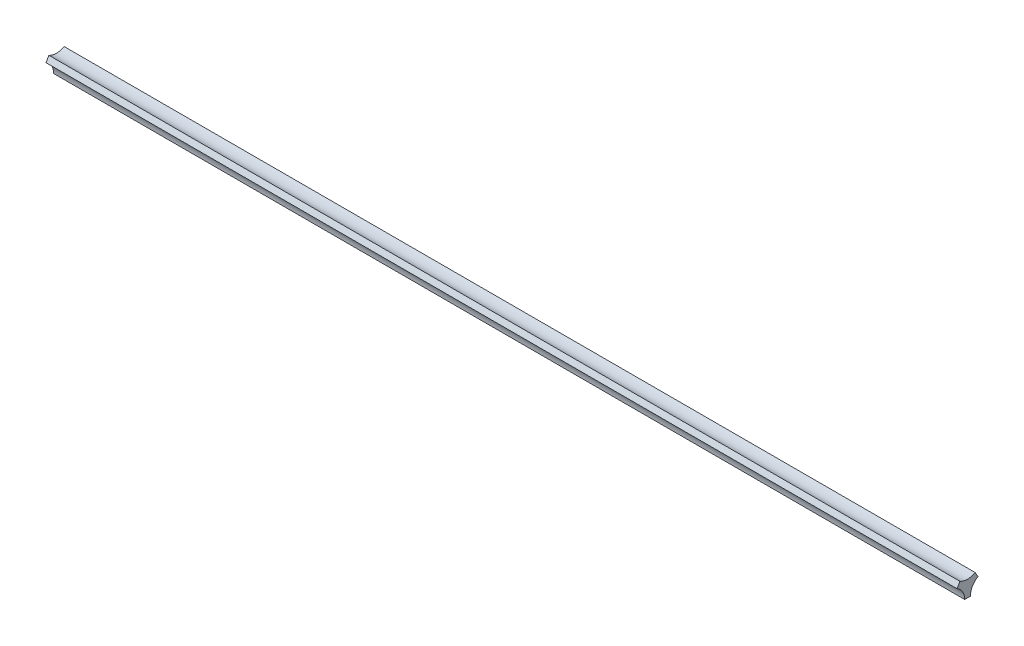
ISO-10303-21;
HEADER;
FILE_DESCRIPTION(('STEP AP214'),'2;1');
FILE_NAME('part.step','',(''),(''),'','','');
FILE_SCHEMA(('AUTOMOTIVE_DESIGN { 1 0 10303 214 1 1 1 1 }'));
ENDSEC;
DATA;
#1=APPLICATION_CONTEXT('core data for automotive mechanical design processes');
#2=APPLICATION_PROTOCOL_DEFINITION('international standard','automotive_design',2000,#1);
#3=PRODUCT_CONTEXT('',#1,'mechanical');
#4=PRODUCT('Part','Part','',(#3));
#5=PRODUCT_RELATED_PRODUCT_CATEGORY('part','',(#4));
#6=PRODUCT_DEFINITION_FORMATION('','',#4);
#7=PRODUCT_DEFINITION_CONTEXT('part definition',#1,'design');
#8=PRODUCT_DEFINITION('design','',#6,#7);
#9=PRODUCT_DEFINITION_SHAPE('','',#8);
#10=(LENGTH_UNIT() NAMED_UNIT(*) SI_UNIT(.MILLI.,.METRE.));
#11=(NAMED_UNIT(*) PLANE_ANGLE_UNIT() SI_UNIT($,.RADIAN.));
#12=(NAMED_UNIT(*) SI_UNIT($,.STERADIAN.) SOLID_ANGLE_UNIT());
#13=UNCERTAINTY_MEASURE_WITH_UNIT(LENGTH_MEASURE(1.E-05),#10,'distance_accuracy_value','');
#14=(GEOMETRIC_REPRESENTATION_CONTEXT(3) GLOBAL_UNCERTAINTY_ASSIGNED_CONTEXT((#13)) GLOBAL_UNIT_ASSIGNED_CONTEXT((#10,
#11,#12)) REPRESENTATION_CONTEXT('',''));
#15=CARTESIAN_POINT('',(0.,0.,0.));
#16=DIRECTION('',(0.,0.,1.));
#17=DIRECTION('',(1.,0.,0.));
#18=AXIS2_PLACEMENT_3D('',#15,#16,#17);
#19=CARTESIAN_POINT('',(2380.,-54.5596004384197,94.4999999999998));
#20=DIRECTION('',(-1.,0.,0.));
#21=DIRECTION('',(0.,0.,1.));
#22=AXIS2_PLACEMENT_3D('',#19,#20,#21);
#23=CYLINDRICAL_SURFACE('',#22,79.4999999999999);
#24=CARTESIAN_POINT('',(-2380.,-54.5596004384197,94.4999999999998));
#25=DIRECTION('',(-1.,0.,0.));
#26=DIRECTION('',(0.,0.,-1.));
#27=AXIS2_PLACEMENT_3D('',#24,#25,#26);
#28=CIRCLE('',#27,79.4999999999999);
#29=CARTESIAN_POINT('',(-2380.,14.2894191624433,54.7500000000003));
#30=VERTEX_POINT('',#29);
#31=CARTESIAN_POINT('',(-2380.,-54.5596004384197,14.9999999999998));
#32=VERTEX_POINT('',#31);
#33=EDGE_CURVE('E117',#30,#32,#28,.T.);
#34=ORIENTED_EDGE('',*,*,#33,.T.);
#35=DIRECTION('',(-1.,0.,0.));
#36=VECTOR('',#35,1.);
#37=CARTESIAN_POINT('',(2380.,-54.5596004384197,14.9999999999998));
#38=LINE('',#37,#36);
#39=CARTESIAN_POINT('',(2380.,-54.5596004384197,14.9999999999998));
#40=VERTEX_POINT('',#39);
#41=EDGE_CURVE('E11',#40,#32,#38,.T.);
#42=ORIENTED_EDGE('',*,*,#41,.F.);
#43=CARTESIAN_POINT('',(2380.,-54.5596004384197,94.4999999999998));
#44=DIRECTION('',(-1.,0.,0.));
#45=DIRECTION('',(0.,0.,-1.));
#46=AXIS2_PLACEMENT_3D('',#43,#44,#45);
#47=CIRCLE('',#46,79.4999999999999);
#48=CARTESIAN_POINT('',(2380.,14.2894191624433,54.7500000000003));
#49=VERTEX_POINT('',#48);
#50=EDGE_CURVE('E127',#49,#40,#47,.T.);
#51=ORIENTED_EDGE('',*,*,#50,.F.);
#52=DIRECTION('',(-1.,0.,0.));
#53=VECTOR('',#52,1.);
#54=CARTESIAN_POINT('',(2380.,14.2894191624433,54.7500000000003));
#55=LINE('',#54,#53);
#56=EDGE_CURVE('E113',#49,#30,#55,.T.);
#57=ORIENTED_EDGE('',*,*,#56,.T.);
#58=EDGE_LOOP('',(#34,#42,#51,#57));
#59=FACE_BOUND('',#58,.T.);
#60=ADVANCED_FACE('F33',(#59),#23,.F.);
#61=CARTESIAN_POINT('',(2380.,-54.5596004384197,14.9999999999998));
#62=DIRECTION('',(0.,1.,0.));
#63=DIRECTION('',(0.,0.,1.));
#64=AXIS2_PLACEMENT_3D('',#61,#62,#63);
#65=PLANE('',#64);
#66=DIRECTION('',(0.,0.,-1.));
#67=VECTOR('',#66,1.);
#68=CARTESIAN_POINT('',(-2380.,-54.5596004384197,14.9999999999998));
#69=LINE('',#68,#67);
#70=CARTESIAN_POINT('',(-2380.,-54.5596004384197,-15.0000000000001));
#71=VERTEX_POINT('',#70);
#72=EDGE_CURVE('E120',#32,#71,#69,.T.);
#73=ORIENTED_EDGE('',*,*,#72,.T.);
#74=DIRECTION('',(-1.,0.,0.));
#75=VECTOR('',#74,1.);
#76=CARTESIAN_POINT('',(2380.,-54.5596004384197,-15.0000000000001));
#77=LINE('',#76,#75);
#78=CARTESIAN_POINT('',(2380.,-54.5596004384197,-15.0000000000001));
#79=VERTEX_POINT('',#78);
#80=EDGE_CURVE('E41',#79,#71,#77,.T.);
#81=ORIENTED_EDGE('',*,*,#80,.F.);
#82=DIRECTION('',(0.,0.,-1.));
#83=VECTOR('',#82,1.);
#84=CARTESIAN_POINT('',(2380.,-54.5596004384197,14.9999999999998));
#85=LINE('',#84,#83);
#86=EDGE_CURVE('E86',#40,#79,#85,.T.);
#87=ORIENTED_EDGE('',*,*,#86,.F.);
#88=ORIENTED_EDGE('',*,*,#41,.T.);
#89=EDGE_LOOP('',(#73,#81,#87,#88));
#90=FACE_BOUND('',#89,.T.);
#91=ADVANCED_FACE('F151',(#90),#65,.F.);
#92=CARTESIAN_POINT('',(2380.,-54.5596004384197,-94.5000000000001));
#93=DIRECTION('',(-1.,0.,0.));
#94=DIRECTION('',(0.,0.,1.));
#95=AXIS2_PLACEMENT_3D('',#92,#93,#94);
#96=CYLINDRICAL_SURFACE('',#95,79.5);
#97=CARTESIAN_POINT('',(-2380.,-54.5596004384197,-94.5000000000001));
#98=DIRECTION('',(-1.,0.,0.));
#99=DIRECTION('',(0.,0.,-1.));
#100=AXIS2_PLACEMENT_3D('',#97,#98,#99);
#101=CIRCLE('',#100,79.5);
#102=CARTESIAN_POINT('',(-2380.,14.2894191624431,-54.75));
#103=VERTEX_POINT('',#102);
#104=EDGE_CURVE('E122',#71,#103,#101,.T.);
#105=ORIENTED_EDGE('',*,*,#104,.T.);
#106=DIRECTION('',(-1.,0.,0.));
#107=VECTOR('',#106,1.);
#108=CARTESIAN_POINT('',(2380.,14.2894191624431,-54.75));
#109=LINE('',#108,#107);
#110=CARTESIAN_POINT('',(2380.,14.2894191624431,-54.75));
#111=VERTEX_POINT('',#110);
#112=EDGE_CURVE('E108',#111,#103,#109,.T.);
#113=ORIENTED_EDGE('',*,*,#112,.F.);
#114=CARTESIAN_POINT('',(2380.,-54.5596004384197,-94.5000000000001));
#115=DIRECTION('',(-1.,0.,0.));
#116=DIRECTION('',(0.,0.,-1.));
#117=AXIS2_PLACEMENT_3D('',#114,#115,#116);
#118=CIRCLE('',#117,79.5);
#119=EDGE_CURVE('E99',#79,#111,#118,.T.);
#120=ORIENTED_EDGE('',*,*,#119,.F.);
#121=ORIENTED_EDGE('',*,*,#80,.T.);
#122=EDGE_LOOP('',(#105,#113,#120,#121));
#123=FACE_BOUND('',#122,.T.);
#124=ADVANCED_FACE('F133',(#123),#96,.F.);
#125=CARTESIAN_POINT('',(2380.,40.2701812759768,-39.7499999999996));
#126=DIRECTION('',(0.,-0.500000000000002,0.866025403784437));
#127=DIRECTION('',(0.,-0.866025403784437,-0.500000000000002));
#128=AXIS2_PLACEMENT_3D('',#125,#126,#127);
#129=PLANE('',#128);
#130=DIRECTION('',(0.,0.866025403784437,0.500000000000002));
#131=VECTOR('',#130,1.);
#132=CARTESIAN_POINT('',(-2380.,40.2701812759768,-39.7499999999996));
#133=LINE('',#132,#131);
#134=CARTESIAN_POINT('',(-2380.,40.2701812759767,-39.7499999999996));
#135=VERTEX_POINT('',#134);
#136=EDGE_CURVE('E107',#103,#135,#133,.T.);
#137=ORIENTED_EDGE('',*,*,#136,.T.);
#138=DIRECTION('',(-1.,0.,0.));
#139=VECTOR('',#138,1.);
#140=CARTESIAN_POINT('',(2380.,40.2701812759767,-39.7499999999996));
#141=LINE('',#140,#139);
#142=CARTESIAN_POINT('',(2380.,40.2701812759767,-39.7499999999996));
#143=VERTEX_POINT('',#142);
#144=EDGE_CURVE('E104',#143,#135,#141,.T.);
#145=ORIENTED_EDGE('',*,*,#144,.F.);
#146=DIRECTION('',(0.,0.866025403784437,0.500000000000002));
#147=VECTOR('',#146,1.);
#148=CARTESIAN_POINT('',(2380.,40.2701812759768,-39.7499999999996));
#149=LINE('',#148,#147);
#150=EDGE_CURVE('E93',#111,#143,#149,.T.);
#151=ORIENTED_EDGE('',*,*,#150,.F.);
#152=ORIENTED_EDGE('',*,*,#112,.T.);
#153=EDGE_LOOP('',(#137,#145,#151,#152));
#154=FACE_BOUND('',#153,.T.);
#155=ADVANCED_FACE('F105',(#154),#129,.F.);
#156=CARTESIAN_POINT('',(2380.,109.119200876839,2.89093532274589E-13));
#157=DIRECTION('',(-1.,0.,0.));
#158=DIRECTION('',(0.,0.,1.));
#159=AXIS2_PLACEMENT_3D('',#156,#157,#158);
#160=CYLINDRICAL_SURFACE('',#159,79.4999999999998);
#161=CARTESIAN_POINT('',(-2380.,109.119200876839,2.89093532274589E-13));
#162=DIRECTION('',(-1.,0.,0.));
#163=DIRECTION('',(0.,0.,-1.));
#164=AXIS2_PLACEMENT_3D('',#161,#162,#163);
#165=CIRCLE('',#164,79.4999999999998);
#166=CARTESIAN_POINT('',(-2380.,40.2701812759765,39.7500000000003));
#167=VERTEX_POINT('',#166);
#168=EDGE_CURVE('E72',#135,#167,#165,.T.);
#169=ORIENTED_EDGE('',*,*,#168,.T.);
#170=DIRECTION('',(-1.,0.,0.));
#171=VECTOR('',#170,1.);
#172=CARTESIAN_POINT('',(2380.,40.2701812759765,39.7500000000003));
#173=LINE('',#172,#171);
#174=CARTESIAN_POINT('',(2380.,40.2701812759765,39.7500000000003));
#175=VERTEX_POINT('',#174);
#176=EDGE_CURVE('E109',#175,#167,#173,.T.);
#177=ORIENTED_EDGE('',*,*,#176,.F.);
#178=CARTESIAN_POINT('',(2380.,109.119200876839,2.89093532274589E-13));
#179=DIRECTION('',(-1.,0.,0.));
#180=DIRECTION('',(0.,0.,-1.));
#181=AXIS2_PLACEMENT_3D('',#178,#179,#180);
#182=CIRCLE('',#181,79.4999999999998);
#183=EDGE_CURVE('E97',#143,#175,#182,.T.);
#184=ORIENTED_EDGE('',*,*,#183,.F.);
#185=ORIENTED_EDGE('',*,*,#144,.T.);
#186=EDGE_LOOP('',(#169,#177,#184,#185));
#187=FACE_BOUND('',#186,.T.);
#188=ADVANCED_FACE('F111',(#187),#160,.F.);
#189=CARTESIAN_POINT('',(2380.,14.2894191624433,54.7500000000003));
#190=DIRECTION('',(0.,-0.499999999999998,-0.86602540378444));
#191=DIRECTION('',(0.,0.86602540378444,-0.499999999999998));
#192=AXIS2_PLACEMENT_3D('',#189,#190,#191);
#193=PLANE('',#192);
#194=DIRECTION('',(0.,-0.86602540378444,0.499999999999998));
#195=VECTOR('',#194,1.);
#196=CARTESIAN_POINT('',(-2380.,14.2894191624433,54.7500000000003));
#197=LINE('',#196,#195);
#198=EDGE_CURVE('E78',#167,#30,#197,.T.);
#199=ORIENTED_EDGE('',*,*,#198,.T.);
#200=ORIENTED_EDGE('',*,*,#56,.F.);
#201=DIRECTION('',(0.,-0.86602540378444,0.499999999999998));
#202=VECTOR('',#201,1.);
#203=CARTESIAN_POINT('',(2380.,14.2894191624433,54.7500000000003));
#204=LINE('',#203,#202);
#205=EDGE_CURVE('E49',#175,#49,#204,.T.);
#206=ORIENTED_EDGE('',*,*,#205,.F.);
#207=ORIENTED_EDGE('',*,*,#176,.T.);
#208=EDGE_LOOP('',(#199,#200,#206,#207));
#209=FACE_BOUND('',#208,.T.);
#210=ADVANCED_FACE('F140',(#209),#193,.F.);
#211=CARTESIAN_POINT('',(2380.,-54.5596004384197,94.4999999999998));
#212=DIRECTION('',(1.,0.,0.));
#213=DIRECTION('',(0.,0.,-1.));
#214=AXIS2_PLACEMENT_3D('',#211,#212,#213);
#215=PLANE('',#214);
#216=ORIENTED_EDGE('',*,*,#50,.T.);
#217=ORIENTED_EDGE('',*,*,#86,.T.);
#218=ORIENTED_EDGE('',*,*,#119,.T.);
#219=ORIENTED_EDGE('',*,*,#150,.T.);
#220=ORIENTED_EDGE('',*,*,#183,.T.);
#221=ORIENTED_EDGE('',*,*,#205,.T.);
#222=EDGE_LOOP('',(#216,#217,#218,#219,#220,#221));
#223=FACE_BOUND('',#222,.T.);
#224=ADVANCED_FACE('F95',(#223),#215,.T.);
#225=CARTESIAN_POINT('',(-2380.,-54.5596004384197,94.4999999999998));
#226=DIRECTION('',(1.,0.,0.));
#227=DIRECTION('',(0.,0.,-1.));
#228=AXIS2_PLACEMENT_3D('',#225,#226,#227);
#229=PLANE('',#228);
#230=ORIENTED_EDGE('',*,*,#33,.F.);
#231=ORIENTED_EDGE('',*,*,#198,.F.);
#232=ORIENTED_EDGE('',*,*,#168,.F.);
#233=ORIENTED_EDGE('',*,*,#136,.F.);
#234=ORIENTED_EDGE('',*,*,#104,.F.);
#235=ORIENTED_EDGE('',*,*,#72,.F.);
#236=EDGE_LOOP('',(#230,#231,#232,#233,#234,#235));
#237=FACE_BOUND('',#236,.T.);
#238=ADVANCED_FACE('F136',(#237),#229,.F.);
#239=CLOSED_SHELL('',(#60,#91,#124,#155,#188,#210,#224,#238));
#240=MANIFOLD_SOLID_BREP('B2',#239);
#241=ADVANCED_BREP_SHAPE_REPRESENTATION('',(#18,#240),#14);
#242=SHAPE_DEFINITION_REPRESENTATION(#9,#241);
ENDSEC;
END-ISO-10303-21;
